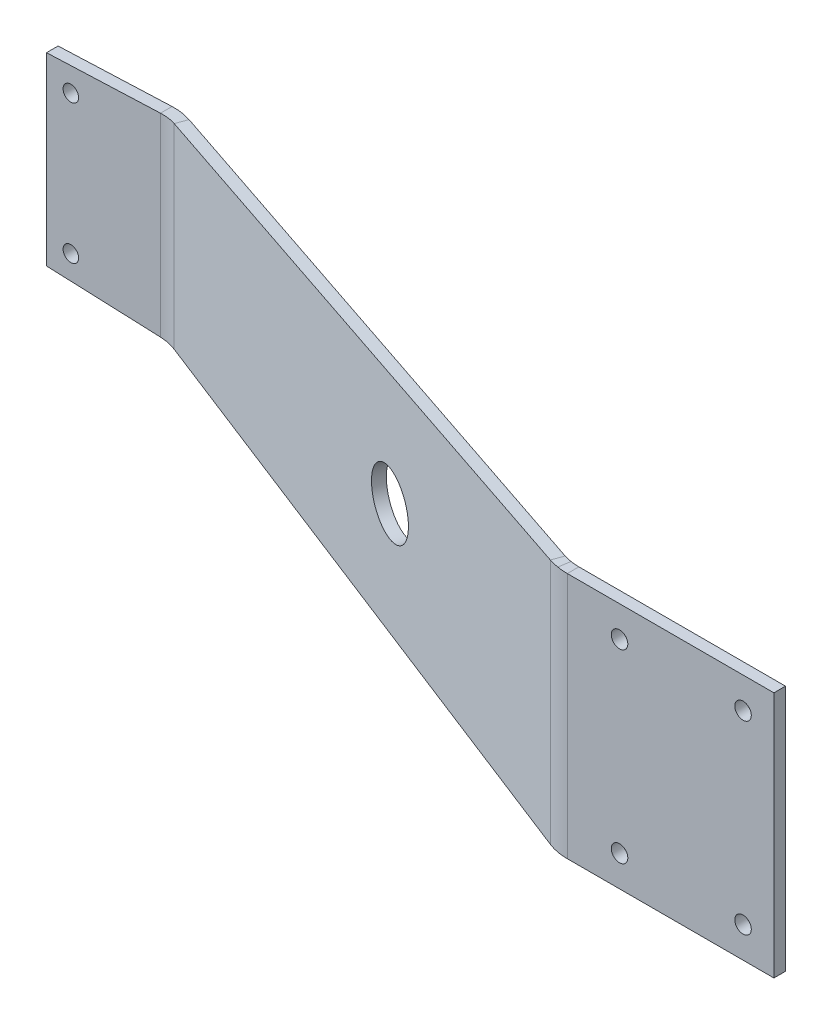
ISO-10303-21;
HEADER;
FILE_DESCRIPTION(('STEP AP214'),'2;1');
FILE_NAME('part.step','',(''),(''),'','','');
FILE_SCHEMA(('AUTOMOTIVE_DESIGN { 1 0 10303 214 1 1 1 1 }'));
ENDSEC;
DATA;
#1=APPLICATION_CONTEXT('core data for automotive mechanical design processes');
#2=APPLICATION_PROTOCOL_DEFINITION('international standard','automotive_design',2000,#1);
#3=PRODUCT_CONTEXT('',#1,'mechanical');
#4=PRODUCT('Part','Part','',(#3));
#5=PRODUCT_RELATED_PRODUCT_CATEGORY('part','',(#4));
#6=PRODUCT_DEFINITION_FORMATION('','',#4);
#7=PRODUCT_DEFINITION_CONTEXT('part definition',#1,'design');
#8=PRODUCT_DEFINITION('design','',#6,#7);
#9=PRODUCT_DEFINITION_SHAPE('','',#8);
#10=(LENGTH_UNIT() NAMED_UNIT(*) SI_UNIT(.MILLI.,.METRE.));
#11=(NAMED_UNIT(*) PLANE_ANGLE_UNIT() SI_UNIT($,.RADIAN.));
#12=(NAMED_UNIT(*) SI_UNIT($,.STERADIAN.) SOLID_ANGLE_UNIT());
#13=UNCERTAINTY_MEASURE_WITH_UNIT(LENGTH_MEASURE(1.E-05),#10,'distance_accuracy_value','');
#14=(GEOMETRIC_REPRESENTATION_CONTEXT(3) GLOBAL_UNCERTAINTY_ASSIGNED_CONTEXT((#13)) GLOBAL_UNIT_ASSIGNED_CONTEXT((#10,
#11,#12)) REPRESENTATION_CONTEXT('',''));
#15=CARTESIAN_POINT('',(0.,0.,0.));
#16=DIRECTION('',(0.,0.,1.));
#17=DIRECTION('',(1.,0.,0.));
#18=AXIS2_PLACEMENT_3D('',#15,#16,#17);
#19=CARTESIAN_POINT('',(1.16353213647621,76.15,-6.37099851140792));
#20=DIRECTION('',(-0.0378529223974013,0.999188341230153,-0.0137773370326425));
#21=DIRECTION('',(0.938929911029287,0.04028223863857,0.341742539676875));
#22=AXIS2_PLACEMENT_3D('',#19,#20,#21);
#23=PLANE('',#22);
#24=DIRECTION('',(0.938929911029287,0.04028223863857,0.341742539676875));
#25=VECTOR('',#24,1.);
#26=CARTESIAN_POINT('',(1.16353213647621,76.15,-6.37099851140792));
#27=LINE('',#26,#25);
#28=CARTESIAN_POINT('',(26.8670689171968,77.25274046049,2.98432379214092));
#29=VERTEX_POINT('',#28);
#30=CARTESIAN_POINT('',(148.504391473481,82.4712595395101,47.2566885784653));
#31=VERTEX_POINT('',#30);
#32=EDGE_CURVE('E616',#29,#31,#27,.T.);
#33=ORIENTED_EDGE('',*,*,#32,.T.);
#34=CARTESIAN_POINT('',(149.318826939775,82.4712595395101,45.0190455252188));
#35=CARTESIAN_POINT('',(148.504391473481,82.4712595395101,47.2566885784653));
#36=B_SPLINE_CURVE_WITH_KNOTS('',1,(#34,#35),.UNSPECIFIED.,.F.,.F.,(2,2),(0.,1.),.UNSPECIFIED.);
#37=CARTESIAN_POINT('',(149.318826939775,82.4712595395101,45.0190455252188));
#38=VERTEX_POINT('',#37);
#39=EDGE_CURVE('E12',#31,#38,#36,.F.);
#40=ORIENTED_EDGE('',*,*,#39,.T.);
#41=DIRECTION('',(0.938929911029287,0.04028223863857,0.341742539676875));
#42=VECTOR('',#41,1.);
#43=CARTESIAN_POINT('',(1.97796760277046,76.15,-8.60864156465436));
#44=LINE('',#43,#42);
#45=CARTESIAN_POINT('',(27.681504383491,77.25274046049,0.746680738894476));
#46=VERTEX_POINT('',#45);
#47=EDGE_CURVE('E549',#46,#38,#44,.T.);
#48=ORIENTED_EDGE('',*,*,#47,.F.);
#49=CARTESIAN_POINT('',(26.8670689171968,77.25274046049,2.98432379214092));
#50=CARTESIAN_POINT('',(27.681504383491,77.25274046049,0.746680738894478));
#51=B_SPLINE_CURVE_WITH_KNOTS('',1,(#49,#50),.UNSPECIFIED.,.F.,.F.,(2,2),(0.,1.),.UNSPECIFIED.);
#52=EDGE_CURVE('E449',#29,#46,#51,.T.);
#53=ORIENTED_EDGE('',*,*,#52,.F.);
#54=EDGE_LOOP('',(#33,#40,#48,#53));
#55=FACE_BOUND('',#54,.T.);
#56=ADVANCED_FACE('F71',(#55),#23,.T.);
#57=CARTESIAN_POINT('',(1.16353213647621,38.15,-6.37099851140792));
#58=DIRECTION('',(-0.037852922397401,-0.999188341230153,-0.0137773370326425));
#59=DIRECTION('',(-0.938929911029287,0.0402822386385698,-0.341742539676875));
#60=AXIS2_PLACEMENT_3D('',#57,#58,#59);
#61=PLANE('',#60);
#62=DIRECTION('',(-0.938929911029287,0.0402822386385698,-0.341742539676875));
#63=VECTOR('',#62,1.);
#64=CARTESIAN_POINT('',(1.97796760277046,38.15,-8.60864156465437));
#65=LINE('',#64,#63);
#66=CARTESIAN_POINT('',(149.318826939775,31.82874046049,45.0190455252188));
#67=VERTEX_POINT('',#66);
#68=CARTESIAN_POINT('',(27.681504383491,37.04725953951,0.746680738894476));
#69=VERTEX_POINT('',#68);
#70=EDGE_CURVE('E98',#67,#69,#65,.T.);
#71=ORIENTED_EDGE('',*,*,#70,.F.);
#72=CARTESIAN_POINT('',(148.504391473481,31.82874046049,47.2566885784653));
#73=CARTESIAN_POINT('',(149.318826939775,31.82874046049,45.0190455252188));
#74=B_SPLINE_CURVE_WITH_KNOTS('',1,(#72,#73),.UNSPECIFIED.,.F.,.F.,(2,2),(0.,1.),.UNSPECIFIED.);
#75=CARTESIAN_POINT('',(148.504391473481,31.82874046049,47.2566885784653));
#76=VERTEX_POINT('',#75);
#77=EDGE_CURVE('E596',#67,#76,#74,.F.);
#78=ORIENTED_EDGE('',*,*,#77,.T.);
#79=DIRECTION('',(-0.938929911029287,0.0402822386385698,-0.341742539676875));
#80=VECTOR('',#79,1.);
#81=CARTESIAN_POINT('',(1.16353213647621,38.15,-6.37099851140792));
#82=LINE('',#81,#80);
#83=CARTESIAN_POINT('',(26.8670689171968,37.04725953951,2.98432379214092));
#84=VERTEX_POINT('',#83);
#85=EDGE_CURVE('E553',#76,#84,#82,.T.);
#86=ORIENTED_EDGE('',*,*,#85,.T.);
#87=CARTESIAN_POINT('',(27.6815043834911,37.04725953951,0.746680738894478));
#88=CARTESIAN_POINT('',(26.8670689171968,37.04725953951,2.98432379214092));
#89=B_SPLINE_CURVE_WITH_KNOTS('',1,(#87,#88),.UNSPECIFIED.,.F.,.F.,(2,2),(0.,1.),.UNSPECIFIED.);
#90=EDGE_CURVE('E463',#69,#84,#89,.T.);
#91=ORIENTED_EDGE('',*,*,#90,.F.);
#92=EDGE_LOOP('',(#71,#78,#86,#91));
#93=FACE_BOUND('',#92,.T.);
#94=ADVANCED_FACE('F563',(#93),#61,.T.);
#95=CARTESIAN_POINT('',(1.97796760277046,0.,-8.60864156465437));
#96=DIRECTION('',(0.342020143325669,0.,-0.939692620785908));
#97=DIRECTION('',(-0.939692620785908,0.,-0.342020143325669));
#98=AXIS2_PLACEMENT_3D('',#95,#96,#97);
#99=PLANE('',#98);
#100=CARTESIAN_POINT('',(97.4507378746187,57.15,26.1406049972336));
#101=DIRECTION('',(0.342020143325669,0.,-0.939692620785908));
#102=DIRECTION('',(-0.939692620785908,0.,-0.342020143325669));
#103=AXIS2_PLACEMENT_3D('',#100,#101,#102);
#104=CIRCLE('',#103,6.35);
#105=CARTESIAN_POINT('',(91.4836897326282,57.15,23.9687770871156));
#106=VERTEX_POINT('',#105);
#107=EDGE_CURVE('E545',#106,#106,#104,.T.);
#108=ORIENTED_EDGE('',*,*,#107,.F.);
#109=EDGE_LOOP('',(#108));
#110=FACE_BOUND('',#109,.T.);
#111=ORIENTED_EDGE('',*,*,#47,.T.);
#112=DIRECTION('',(0.,-1.,0.));
#113=VECTOR('',#112,1.);
#114=CARTESIAN_POINT('',(149.318826939775,0.,45.0190455252188));
#115=LINE('',#114,#113);
#116=EDGE_CURVE('E82',#38,#67,#115,.T.);
#117=ORIENTED_EDGE('',*,*,#116,.T.);
#118=ORIENTED_EDGE('',*,*,#70,.T.);
#119=DIRECTION('',(0.,-1.,0.));
#120=VECTOR('',#119,1.);
#121=CARTESIAN_POINT('',(27.681504383491,0.,0.746680738894476));
#122=LINE('',#121,#120);
#123=EDGE_CURVE('E561',#46,#69,#122,.T.);
#124=ORIENTED_EDGE('',*,*,#123,.F.);
#125=EDGE_LOOP('',(#111,#117,#118,#124));
#126=FACE_BOUND('',#125,.T.);
#127=ADVANCED_FACE('F73',(#110,#126),#99,.T.);
#128=CARTESIAN_POINT('',(1.16353213647621,0.,-6.37099851140793));
#129=DIRECTION('',(0.342020143325669,0.,-0.939692620785908));
#130=DIRECTION('',(-0.939692620785908,0.,-0.342020143325669));
#131=AXIS2_PLACEMENT_3D('',#128,#129,#130);
#132=PLANE('',#131);
#133=DIRECTION('',(0.,-1.,0.));
#134=VECTOR('',#133,1.);
#135=CARTESIAN_POINT('',(148.504391473481,0.,47.2566885784653));
#136=LINE('',#135,#134);
#137=EDGE_CURVE('E589',#31,#76,#136,.T.);
#138=ORIENTED_EDGE('',*,*,#137,.F.);
#139=ORIENTED_EDGE('',*,*,#32,.F.);
#140=DIRECTION('',(0.,-1.,0.));
#141=VECTOR('',#140,1.);
#142=CARTESIAN_POINT('',(26.8670689171968,0.,2.98432379214092));
#143=LINE('',#142,#141);
#144=EDGE_CURVE('E550',#29,#84,#143,.T.);
#145=ORIENTED_EDGE('',*,*,#144,.T.);
#146=ORIENTED_EDGE('',*,*,#85,.F.);
#147=EDGE_LOOP('',(#138,#139,#145,#146));
#148=FACE_BOUND('',#147,.T.);
#149=CARTESIAN_POINT('',(96.6363024083245,57.15,28.3782480504801));
#150=DIRECTION('',(-0.342020143325669,0.,0.939692620785908));
#151=DIRECTION('',(0.939692620785908,0.,0.342020143325669));
#152=AXIS2_PLACEMENT_3D('',#149,#150,#151);
#153=CIRCLE('',#152,6.35);
#154=CARTESIAN_POINT('',(102.603350550315,57.15,30.5500759605981));
#155=VERTEX_POINT('',#154);
#156=EDGE_CURVE('E542',#155,#155,#153,.T.);
#157=ORIENTED_EDGE('',*,*,#156,.F.);
#158=EDGE_LOOP('',(#157));
#159=FACE_BOUND('',#158,.T.);
#160=ADVANCED_FACE('F576',(#148,#159),#132,.F.);
#161=CARTESIAN_POINT('',(97.5050335723717,57.15,25.9914287936839));
#162=DIRECTION('',(-0.342020143325669,0.,0.939692620785908));
#163=DIRECTION('',(0.939692620785908,0.,0.342020143325669));
#164=AXIS2_PLACEMENT_3D('',#161,#162,#163);
#165=CYLINDRICAL_SURFACE('',#164,6.35);
#166=ORIENTED_EDGE('',*,*,#107,.T.);
#167=EDGE_LOOP('',(#166));
#168=FACE_BOUND('',#167,.T.);
#169=ORIENTED_EDGE('',*,*,#156,.T.);
#170=EDGE_LOOP('',(#169));
#171=FACE_BOUND('',#170,.T.);
#172=ADVANCED_FACE('F525',(#168,#171),#165,.F.);
#173=CARTESIAN_POINT('',(0.,82.55,2.38125));
#174=DIRECTION('',(1.,0.,0.));
#175=DIRECTION('',(0.,-1.,0.));
#176=AXIS2_PLACEMENT_3D('',#173,#174,#175);
#177=PLANE('',#176);
#178=DIRECTION('',(0.,0.,1.));
#179=VECTOR('',#178,1.);
#180=CARTESIAN_POINT('',(0.,76.15,2.38125));
#181=LINE('',#180,#179);
#182=CARTESIAN_POINT('',(0.,76.15,0.));
#183=VERTEX_POINT('',#182);
#184=CARTESIAN_POINT('',(0.,76.15,2.38125));
#185=VERTEX_POINT('',#184);
#186=EDGE_CURVE('E467',#183,#185,#181,.T.);
#187=ORIENTED_EDGE('',*,*,#186,.F.);
#188=DIRECTION('',(0.,1.,0.));
#189=VECTOR('',#188,1.);
#190=CARTESIAN_POINT('',(0.,0.,0.));
#191=LINE('',#190,#189);
#192=CARTESIAN_POINT('',(0.,38.15,0.));
#193=VERTEX_POINT('',#192);
#194=EDGE_CURVE('E483',#183,#193,#191,.F.);
#195=ORIENTED_EDGE('',*,*,#194,.T.);
#196=DIRECTION('',(0.,0.,1.));
#197=VECTOR('',#196,1.);
#198=CARTESIAN_POINT('',(0.,38.15,2.38125));
#199=LINE('',#198,#197);
#200=CARTESIAN_POINT('',(0.,38.15,2.38125));
#201=VERTEX_POINT('',#200);
#202=EDGE_CURVE('E480',#193,#201,#199,.T.);
#203=ORIENTED_EDGE('',*,*,#202,.T.);
#204=DIRECTION('',(0.,-1.,0.));
#205=VECTOR('',#204,1.);
#206=CARTESIAN_POINT('',(0.,82.55,2.38125));
#207=LINE('',#206,#205);
#208=EDGE_CURVE('E476',#185,#201,#207,.T.);
#209=ORIENTED_EDGE('',*,*,#208,.F.);
#210=EDGE_LOOP('',(#187,#195,#203,#209));
#211=FACE_BOUND('',#210,.T.);
#212=ADVANCED_FACE('F423',(#211),#177,.F.);
#213=CARTESIAN_POINT('',(0.,0.,2.38125));
#214=DIRECTION('',(0.,0.,-1.));
#215=DIRECTION('',(-1.,0.,0.));
#216=AXIS2_PLACEMENT_3D('',#213,#214,#215);
#217=PLANE('',#216);
#218=CARTESIAN_POINT('',(5.00000000000003,71.4375,2.38125));
#219=DIRECTION('',(0.,0.,1.));
#220=DIRECTION('',(1.,0.,0.));
#221=AXIS2_PLACEMENT_3D('',#218,#219,#220);
#222=CIRCLE('',#221,1.6);
#223=CARTESIAN_POINT('',(6.60000000000003,71.4375,2.38125));
#224=VERTEX_POINT('',#223);
#225=EDGE_CURVE('E720',#224,#224,#222,.T.);
#226=ORIENTED_EDGE('',*,*,#225,.F.);
#227=EDGE_LOOP('',(#226));
#228=FACE_BOUND('',#227,.T.);
#229=CARTESIAN_POINT('',(5.00000000000003,42.8625,2.38125));
#230=DIRECTION('',(0.,0.,1.));
#231=DIRECTION('',(1.,0.,0.));
#232=AXIS2_PLACEMENT_3D('',#229,#230,#231);
#233=CIRCLE('',#232,1.6);
#234=CARTESIAN_POINT('',(6.60000000000003,42.8625,2.38125));
#235=VERTEX_POINT('',#234);
#236=EDGE_CURVE('E714',#235,#235,#233,.T.);
#237=ORIENTED_EDGE('',*,*,#236,.F.);
#238=EDGE_LOOP('',(#237));
#239=FACE_BOUND('',#238,.T.);
#240=DIRECTION('',(0.,-1.,0.));
#241=VECTOR('',#240,1.);
#242=CARTESIAN_POINT('',(23.4468674839401,0.,2.38125));
#243=LINE('',#242,#241);
#244=CARTESIAN_POINT('',(23.4468674839401,77.09525953951,2.38125));
#245=VERTEX_POINT('',#244);
#246=CARTESIAN_POINT('',(23.4468674839401,37.20474046049,2.38125));
#247=VERTEX_POINT('',#246);
#248=EDGE_CURVE('E486',#245,#247,#243,.T.);
#249=ORIENTED_EDGE('',*,*,#248,.F.);
#250=DIRECTION('',(0.999188341230153,0.0402822386385701,0.));
#251=VECTOR('',#250,1.);
#252=CARTESIAN_POINT('',(0.,76.15,2.38125));
#253=LINE('',#252,#251);
#254=EDGE_CURVE('E479',#185,#245,#253,.T.);
#255=ORIENTED_EDGE('',*,*,#254,.F.);
#256=ORIENTED_EDGE('',*,*,#208,.T.);
#257=DIRECTION('',(-0.999188341230153,0.0402822386385698,0.));
#258=VECTOR('',#257,1.);
#259=CARTESIAN_POINT('',(0.,38.15,2.38125));
#260=LINE('',#259,#258);
#261=EDGE_CURVE('E546',#247,#201,#260,.T.);
#262=ORIENTED_EDGE('',*,*,#261,.F.);
#263=EDGE_LOOP('',(#249,#255,#256,#262));
#264=FACE_BOUND('',#263,.T.);
#265=ADVANCED_FACE('F517',(#228,#239,#264),#217,.F.);
#266=CARTESIAN_POINT('',(0.,76.15,2.38125));
#267=DIRECTION('',(-0.0402822386385701,0.999188341230153,0.));
#268=DIRECTION('',(0.999188341230153,0.0402822386385701,0.));
#269=AXIS2_PLACEMENT_3D('',#266,#267,#268);
#270=PLANE('',#269);
#271=ORIENTED_EDGE('',*,*,#254,.T.);
#272=CARTESIAN_POINT('',(23.4468674839401,77.09525953951,0.));
#273=CARTESIAN_POINT('',(23.4468674839401,77.09525953951,2.38125));
#274=B_SPLINE_CURVE_WITH_KNOTS('',1,(#272,#273),.UNSPECIFIED.,.F.,.F.,(2,2),(0.,1.),.UNSPECIFIED.);
#275=CARTESIAN_POINT('',(23.4468674839401,77.09525953951,0.));
#276=VERTEX_POINT('',#275);
#277=EDGE_CURVE('E475',#245,#276,#274,.F.);
#278=ORIENTED_EDGE('',*,*,#277,.T.);
#279=DIRECTION('',(0.999188341230153,0.0402822386385701,0.));
#280=VECTOR('',#279,1.);
#281=CARTESIAN_POINT('',(0.,76.15,0.));
#282=LINE('',#281,#280);
#283=EDGE_CURVE('E474',#183,#276,#282,.T.);
#284=ORIENTED_EDGE('',*,*,#283,.F.);
#285=ORIENTED_EDGE('',*,*,#186,.T.);
#286=EDGE_LOOP('',(#271,#278,#284,#285));
#287=FACE_BOUND('',#286,.T.);
#288=ADVANCED_FACE('F507',(#287),#270,.T.);
#289=CARTESIAN_POINT('',(0.,0.,0.));
#290=DIRECTION('',(0.,0.,-1.));
#291=DIRECTION('',(-1.,0.,0.));
#292=AXIS2_PLACEMENT_3D('',#289,#290,#291);
#293=PLANE('',#292);
#294=CARTESIAN_POINT('',(5.00000000000003,71.4375,0.));
#295=DIRECTION('',(0.,0.,-1.));
#296=DIRECTION('',(-1.,0.,0.));
#297=AXIS2_PLACEMENT_3D('',#294,#295,#296);
#298=CIRCLE('',#297,1.6);
#299=CARTESIAN_POINT('',(3.40000000000003,71.4375,0.));
#300=VERTEX_POINT('',#299);
#301=EDGE_CURVE('E717',#300,#300,#298,.T.);
#302=ORIENTED_EDGE('',*,*,#301,.F.);
#303=EDGE_LOOP('',(#302));
#304=FACE_BOUND('',#303,.T.);
#305=CARTESIAN_POINT('',(5.00000000000003,42.8625,0.));
#306=DIRECTION('',(0.,0.,-1.));
#307=DIRECTION('',(-1.,0.,0.));
#308=AXIS2_PLACEMENT_3D('',#305,#306,#307);
#309=CIRCLE('',#308,1.6);
#310=CARTESIAN_POINT('',(3.40000000000003,42.8625,0.));
#311=VERTEX_POINT('',#310);
#312=EDGE_CURVE('E210',#311,#311,#309,.T.);
#313=ORIENTED_EDGE('',*,*,#312,.F.);
#314=EDGE_LOOP('',(#313));
#315=FACE_BOUND('',#314,.T.);
#316=ORIENTED_EDGE('',*,*,#283,.T.);
#317=DIRECTION('',(0.,-1.,0.));
#318=VECTOR('',#317,1.);
#319=CARTESIAN_POINT('',(23.4468674839401,0.,0.));
#320=LINE('',#319,#318);
#321=CARTESIAN_POINT('',(23.4468674839401,37.20474046049,0.));
#322=VERTEX_POINT('',#321);
#323=EDGE_CURVE('E487',#276,#322,#320,.T.);
#324=ORIENTED_EDGE('',*,*,#323,.T.);
#325=DIRECTION('',(-0.999188341230153,0.0402822386385698,0.));
#326=VECTOR('',#325,1.);
#327=CARTESIAN_POINT('',(0.,38.15,0.));
#328=LINE('',#327,#326);
#329=EDGE_CURVE('E490',#322,#193,#328,.T.);
#330=ORIENTED_EDGE('',*,*,#329,.T.);
#331=ORIENTED_EDGE('',*,*,#194,.F.);
#332=EDGE_LOOP('',(#316,#324,#330,#331));
#333=FACE_BOUND('',#332,.T.);
#334=ADVANCED_FACE('F516',(#304,#315,#333),#293,.T.);
#335=CARTESIAN_POINT('',(0.,38.15,2.38125));
#336=DIRECTION('',(-0.0402822386385698,-0.999188341230153,0.));
#337=DIRECTION('',(-0.999188341230153,0.0402822386385698,0.));
#338=AXIS2_PLACEMENT_3D('',#335,#336,#337);
#339=PLANE('',#338);
#340=ORIENTED_EDGE('',*,*,#329,.F.);
#341=CARTESIAN_POINT('',(23.4468674839401,37.20474046049,2.38125));
#342=CARTESIAN_POINT('',(23.4468674839401,37.20474046049,0.));
#343=B_SPLINE_CURVE_WITH_KNOTS('',1,(#341,#342),.UNSPECIFIED.,.F.,.F.,(2,2),(0.,1.),.UNSPECIFIED.);
#344=EDGE_CURVE('E539',#322,#247,#343,.F.);
#345=ORIENTED_EDGE('',*,*,#344,.T.);
#346=ORIENTED_EDGE('',*,*,#261,.T.);
#347=ORIENTED_EDGE('',*,*,#202,.F.);
#348=EDGE_LOOP('',(#340,#345,#346,#347));
#349=FACE_BOUND('',#348,.T.);
#350=ADVANCED_FACE('F419',(#349),#339,.T.);
#351=CARTESIAN_POINT('',(27.681504383491,77.25274046049,0.746680738894478));
#352=CARTESIAN_POINT('',(26.3272425370765,77.2002267244741,0.253769737397179));
#353=CARTESIAN_POINT('',(24.8880428390067,77.1477732755259,0.));
#354=CARTESIAN_POINT('',(23.4468674839401,77.09525953951,0.));
#355=CARTESIAN_POINT('',(26.8670689171968,77.25274046049,2.98432379214092));
#356=CARTESIAN_POINT('',(25.7732685846946,77.2002267364846,2.58621302887965));
#357=CARTESIAN_POINT('',(24.6108654853157,77.1477732635154,2.38125));
#358=CARTESIAN_POINT('',(23.4468674839401,77.09525953951,2.38125));
#359=B_SPLINE_SURFACE_WITH_KNOTS('',1,3,((#351,#352,#353,#354),(#355,#356,#357,#358)),
.UNSPECIFIED.,.F.,.F.,.F.,(2,2),(4,4),(0.,1.),(0.,1.),.UNSPECIFIED.);
#360=CARTESIAN_POINT('',(27.681504383491,77.25274046049,0.746680738894478));
#361=CARTESIAN_POINT('',(26.3272425370765,77.2002267244741,0.253769737397179));
#362=CARTESIAN_POINT('',(24.8880428390067,77.1477732755259,0.));
#363=CARTESIAN_POINT('',(23.4468674839401,77.09525953951,0.));
#364=B_SPLINE_CURVE_WITH_KNOTS('',3,(#360,#361,#362,#363),.UNSPECIFIED.,.F.,.F.,(4,4),(0.,1.),.UNSPECIFIED.);
#365=EDGE_CURVE('E391',#46,#276,#364,.T.);
#366=CARTESIAN_POINT('',(23.4468674839401,77.09525953951,2.38125));
#367=CARTESIAN_POINT('',(24.6108654853157,77.1477732635154,2.38125));
#368=CARTESIAN_POINT('',(25.7732685846946,77.2002267364846,2.58621302887965));
#369=CARTESIAN_POINT('',(26.8670689171968,77.25274046049,2.98432379214092));
#370=B_SPLINE_CURVE_WITH_KNOTS('',3,(#366,#367,#368,#369),.UNSPECIFIED.,.F.,.F.,(4,4),(0.,1.),.UNSPECIFIED.);
#371=EDGE_CURVE('E384',#29,#245,#370,.F.);
#372=ORIENTED_EDGE('',*,*,#52,.T.);
#373=ORIENTED_EDGE('',*,*,#365,.T.);
#374=ORIENTED_EDGE('',*,*,#277,.F.);
#375=ORIENTED_EDGE('',*,*,#371,.F.);
#376=EDGE_LOOP('',(#372,#373,#374,#375));
#377=FACE_BOUND('',#376,.T.);
#378=ADVANCED_FACE('F408',(#377),#359,.F.);
#379=CARTESIAN_POINT('',(23.4468674839401,37.20474046049,0.));
#380=CARTESIAN_POINT('',(24.8880428390067,37.1522267244741,0.));
#381=CARTESIAN_POINT('',(26.3272425370764,37.0997732755259,0.253769737397168));
#382=CARTESIAN_POINT('',(27.6815043834911,37.04725953951,0.746680738894478));
#383=CARTESIAN_POINT('',(23.4468674839401,37.20474046049,2.38125));
#384=CARTESIAN_POINT('',(24.6108654853157,37.1522267364846,2.38125));
#385=CARTESIAN_POINT('',(25.7732685846946,37.0997732635154,2.58621302887965));
#386=CARTESIAN_POINT('',(26.8670689171968,37.04725953951,2.98432379214092));
#387=B_SPLINE_SURFACE_WITH_KNOTS('',1,3,((#379,#380,#381,#382),(#383,#384,#385,#386)),
.UNSPECIFIED.,.F.,.F.,.F.,(2,2),(4,4),(0.,1.),(0.,1.),.UNSPECIFIED.);
#388=CARTESIAN_POINT('',(23.4468674839401,37.20474046049,0.));
#389=CARTESIAN_POINT('',(24.8880428390067,37.1522267244741,0.));
#390=CARTESIAN_POINT('',(26.3272425370764,37.0997732755259,0.253769737397168));
#391=CARTESIAN_POINT('',(27.6815043834911,37.04725953951,0.746680738894478));
#392=B_SPLINE_CURVE_WITH_KNOTS('',3,(#388,#389,#390,#391),.UNSPECIFIED.,.F.,.F.,(4,4),(0.,1.),.UNSPECIFIED.);
#393=EDGE_CURVE('E618',#322,#69,#392,.T.);
#394=CARTESIAN_POINT('',(26.8670689171968,37.04725953951,2.98432379214092));
#395=CARTESIAN_POINT('',(25.7732685846946,37.0997732635154,2.58621302887965));
#396=CARTESIAN_POINT('',(24.6108654853157,37.1522267364846,2.38125));
#397=CARTESIAN_POINT('',(23.4468674839401,37.20474046049,2.38125));
#398=B_SPLINE_CURVE_WITH_KNOTS('',3,(#394,#395,#396,#397),.UNSPECIFIED.,.F.,.F.,(4,4),(0.,1.),.UNSPECIFIED.);
#399=EDGE_CURVE('E653',#247,#84,#398,.F.);
#400=ORIENTED_EDGE('',*,*,#344,.F.);
#401=ORIENTED_EDGE('',*,*,#393,.T.);
#402=ORIENTED_EDGE('',*,*,#90,.T.);
#403=ORIENTED_EDGE('',*,*,#399,.F.);
#404=EDGE_LOOP('',(#400,#401,#402,#403));
#405=FACE_BOUND('',#404,.T.);
#406=ADVANCED_FACE('F362',(#405),#387,.F.);
#407=CARTESIAN_POINT('',(23.4468674839401,16.685077484926,12.38125));
#408=DIRECTION('',(0.,1.,0.));
#409=DIRECTION('',(-1.,0.,0.));
#410=AXIS2_PLACEMENT_3D('',#407,#408,#409);
#411=CYLINDRICAL_SURFACE('',#410,10.);
#412=ORIENTED_EDGE('',*,*,#399,.T.);
#413=ORIENTED_EDGE('',*,*,#144,.F.);
#414=ORIENTED_EDGE('',*,*,#371,.T.);
#415=ORIENTED_EDGE('',*,*,#248,.T.);
#416=EDGE_LOOP('',(#412,#413,#414,#415));
#417=FACE_BOUND('',#416,.T.);
#418=ADVANCED_FACE('F353',(#417),#411,.F.);
#419=CARTESIAN_POINT('',(23.4468674839401,16.685077484926,12.38125));
#420=DIRECTION('',(0.,1.,0.));
#421=DIRECTION('',(-1.,0.,0.));
#422=AXIS2_PLACEMENT_3D('',#419,#420,#421);
#423=CYLINDRICAL_SURFACE('',#422,12.38125);
#424=ORIENTED_EDGE('',*,*,#393,.F.);
#425=ORIENTED_EDGE('',*,*,#323,.F.);
#426=ORIENTED_EDGE('',*,*,#365,.F.);
#427=ORIENTED_EDGE('',*,*,#123,.T.);
#428=EDGE_LOOP('',(#424,#425,#426,#427));
#429=FACE_BOUND('',#428,.T.);
#430=ADVANCED_FACE('F299',(#429),#423,.T.);
#431=CARTESIAN_POINT('',(150.589046873293,82.55,47.8152703093421));
#432=CARTESIAN_POINT('',(149.879658823564,82.5237524664823,47.6901860563828));
#433=CARTESIAN_POINT('',(149.181281672167,82.4975070730278,47.5030564626535));
#434=CARTESIAN_POINT('',(148.504391473481,82.4712595395101,47.2566885784653));
#435=CARTESIAN_POINT('',(151.002546596362,82.55,45.4701968474818));
#436=CARTESIAN_POINT('',(150.429593108864,82.523752466964,45.3691696889448));
#437=CARTESIAN_POINT('',(149.865532794404,82.497507072546,45.218030183203));
#438=CARTESIAN_POINT('',(149.318826939775,82.4712595395101,45.0190455252188));
#439=B_SPLINE_SURFACE_WITH_KNOTS('',1,3,((#431,#432,#433,#434),(#435,#436,#437,#438)),
.UNSPECIFIED.,.F.,.F.,.F.,(2,2),(4,4),(0.,1.),(0.,1.),.UNSPECIFIED.);
#440=CARTESIAN_POINT('',(150.589046873293,82.55,47.8152703093421));
#441=CARTESIAN_POINT('',(151.002546596362,82.55,45.4701968474818));
#442=B_SPLINE_CURVE_WITH_KNOTS('',1,(#440,#441),.UNSPECIFIED.,.F.,.F.,(2,2),(0.,1.),.UNSPECIFIED.);
#443=CARTESIAN_POINT('',(151.002546596362,82.55,45.4701968474818));
#444=VERTEX_POINT('',#443);
#445=CARTESIAN_POINT('',(150.589046873293,82.55,47.8152703093421));
#446=VERTEX_POINT('',#445);
#447=EDGE_CURVE('E331',#444,#446,#442,.F.);
#448=CARTESIAN_POINT('',(151.002546596362,82.55,45.4701968474818));
#449=CARTESIAN_POINT('',(150.429593108864,82.523752466964,45.3691696889448));
#450=CARTESIAN_POINT('',(149.865532794404,82.497507072546,45.218030183203));
#451=CARTESIAN_POINT('',(149.318826939775,82.4712595395101,45.0190455252188));
#452=B_SPLINE_CURVE_WITH_KNOTS('',3,(#448,#449,#450,#451),.UNSPECIFIED.,.F.,.F.,(4,4),(0.,1.),.UNSPECIFIED.);
#453=EDGE_CURVE('E89',#444,#38,#452,.T.);
#454=CARTESIAN_POINT('',(148.504391473481,82.4712595395101,47.2566885784653));
#455=CARTESIAN_POINT('',(149.181281672167,82.4975070730278,47.5030564626535));
#456=CARTESIAN_POINT('',(149.879658823564,82.5237524664823,47.6901860563828));
#457=CARTESIAN_POINT('',(150.589046873293,82.55,47.8152703093421));
#458=B_SPLINE_CURVE_WITH_KNOTS('',3,(#454,#455,#456,#457),.UNSPECIFIED.,.F.,.F.,(4,4),(0.,1.),.UNSPECIFIED.);
#459=EDGE_CURVE('E260',#446,#31,#458,.F.);
#460=ORIENTED_EDGE('',*,*,#447,.F.);
#461=ORIENTED_EDGE('',*,*,#453,.T.);
#462=ORIENTED_EDGE('',*,*,#39,.F.);
#463=ORIENTED_EDGE('',*,*,#459,.F.);
#464=EDGE_LOOP('',(#460,#461,#462,#463));
#465=FACE_BOUND('',#464,.T.);
#466=ADVANCED_FACE('F287',(#465),#439,.T.);
#467=CARTESIAN_POINT('',(148.504391473481,31.82874046049,47.2566885784653));
#468=CARTESIAN_POINT('',(149.181281672167,31.8024929269723,47.5030564626535));
#469=CARTESIAN_POINT('',(149.879658823564,31.7762475335177,47.6901860563828));
#470=CARTESIAN_POINT('',(150.589046873293,31.75,47.8152703093421));
#471=CARTESIAN_POINT('',(149.318826939775,31.82874046049,45.0190455252188));
#472=CARTESIAN_POINT('',(149.865532794404,31.802492927454,45.218030183203));
#473=CARTESIAN_POINT('',(150.429593108863,31.776247533036,45.3691696889448));
#474=CARTESIAN_POINT('',(151.002546596362,31.75,45.4701968474818));
#475=B_SPLINE_SURFACE_WITH_KNOTS('',1,3,((#467,#468,#469,#470),(#471,#472,#473,#474)),
.UNSPECIFIED.,.F.,.F.,.F.,(2,2),(4,4),(0.,1.),(0.,1.),.UNSPECIFIED.);
#476=CARTESIAN_POINT('',(149.318826939775,31.82874046049,45.0190455252188));
#477=CARTESIAN_POINT('',(149.865532794404,31.802492927454,45.218030183203));
#478=CARTESIAN_POINT('',(150.429593108863,31.776247533036,45.3691696889448));
#479=CARTESIAN_POINT('',(151.002546596362,31.75,45.4701968474818));
#480=B_SPLINE_CURVE_WITH_KNOTS('',3,(#476,#477,#478,#479),.UNSPECIFIED.,.F.,.F.,(4,4),(0.,1.),.UNSPECIFIED.);
#481=CARTESIAN_POINT('',(151.002546596362,31.75,45.4701968474818));
#482=VERTEX_POINT('',#481);
#483=EDGE_CURVE('E215',#67,#482,#480,.T.);
#484=CARTESIAN_POINT('',(151.002546596362,31.75,45.4701968474818));
#485=CARTESIAN_POINT('',(150.589046873293,31.75,47.8152703093421));
#486=B_SPLINE_CURVE_WITH_KNOTS('',1,(#484,#485),.UNSPECIFIED.,.F.,.F.,(2,2),(0.,1.),.UNSPECIFIED.);
#487=CARTESIAN_POINT('',(150.589046873293,31.75,47.8152703093421));
#488=VERTEX_POINT('',#487);
#489=EDGE_CURVE('E264',#482,#488,#486,.T.);
#490=CARTESIAN_POINT('',(150.589046873293,31.75,47.8152703093421));
#491=CARTESIAN_POINT('',(149.879658823564,31.7762475335177,47.6901860563828));
#492=CARTESIAN_POINT('',(149.181281672167,31.8024929269723,47.5030564626535));
#493=CARTESIAN_POINT('',(148.504391473481,31.82874046049,47.2566885784653));
#494=B_SPLINE_CURVE_WITH_KNOTS('',3,(#490,#491,#492,#493),.UNSPECIFIED.,.F.,.F.,(4,4),(0.,1.),.UNSPECIFIED.);
#495=EDGE_CURVE('E684',#76,#488,#494,.F.);
#496=ORIENTED_EDGE('',*,*,#77,.F.);
#497=ORIENTED_EDGE('',*,*,#483,.T.);
#498=ORIENTED_EDGE('',*,*,#489,.T.);
#499=ORIENTED_EDGE('',*,*,#495,.F.);
#500=EDGE_LOOP('',(#496,#497,#498,#499));
#501=FACE_BOUND('',#500,.T.);
#502=ADVANCED_FACE('F298',(#501),#475,.T.);
#503=CARTESIAN_POINT('',(152.739028373032,31.75,35.6221193173597));
#504=DIRECTION('',(0.,-1.,0.));
#505=DIRECTION('',(0.,0.,-1.));
#506=AXIS2_PLACEMENT_3D('',#503,#504,#505);
#507=PLANE('',#506);
#508=ORIENTED_EDGE('',*,*,#489,.F.);
#509=CARTESIAN_POINT('',(152.739028373032,31.75,35.6221193173597));
#510=DIRECTION('',(0.,1.,0.));
#511=DIRECTION('',(0.,0.,1.));
#512=AXIS2_PLACEMENT_3D('',#509,#510,#511);
#513=CIRCLE('',#512,10.);
#514=CARTESIAN_POINT('',(152.739028373032,31.75,45.6221193173597));
#515=VERTEX_POINT('',#514);
#516=EDGE_CURVE('E211',#482,#515,#513,.T.);
#517=ORIENTED_EDGE('',*,*,#516,.T.);
#518=DIRECTION('',(0.,0.,1.));
#519=VECTOR('',#518,1.);
#520=CARTESIAN_POINT('',(152.739028373032,31.75,48.0033693173597));
#521=LINE('',#520,#519);
#522=CARTESIAN_POINT('',(152.739028373032,31.75,48.0033693173597));
#523=VERTEX_POINT('',#522);
#524=EDGE_CURVE('E201',#515,#523,#521,.T.);
#525=ORIENTED_EDGE('',*,*,#524,.T.);
#526=CARTESIAN_POINT('',(152.739028373032,31.75,35.6221193173597));
#527=DIRECTION('',(0.,1.,0.));
#528=DIRECTION('',(0.,0.,1.));
#529=AXIS2_PLACEMENT_3D('',#526,#527,#528);
#530=CIRCLE('',#529,12.38125);
#531=EDGE_CURVE('E222',#488,#523,#530,.T.);
#532=ORIENTED_EDGE('',*,*,#531,.F.);
#533=EDGE_LOOP('',(#508,#517,#525,#532));
#534=FACE_BOUND('',#533,.T.);
#535=ADVANCED_FACE('F695',(#534),#507,.T.);
#536=CARTESIAN_POINT('',(152.739028373032,82.55,35.6221193173597));
#537=DIRECTION('',(0.,1.,0.));
#538=DIRECTION('',(0.,0.,1.));
#539=AXIS2_PLACEMENT_3D('',#536,#537,#538);
#540=PLANE('',#539);
#541=CARTESIAN_POINT('',(152.739028373032,82.55,35.6221193173597));
#542=DIRECTION('',(0.,1.,0.));
#543=DIRECTION('',(0.,0.,1.));
#544=AXIS2_PLACEMENT_3D('',#541,#542,#543);
#545=CIRCLE('',#544,10.);
#546=CARTESIAN_POINT('',(152.739028373032,82.55,45.6221193173597));
#547=VERTEX_POINT('',#546);
#548=EDGE_CURVE('E214',#547,#444,#545,.F.);
#549=ORIENTED_EDGE('',*,*,#548,.T.);
#550=ORIENTED_EDGE('',*,*,#447,.T.);
#551=CARTESIAN_POINT('',(152.739028373032,82.55,35.6221193173597));
#552=DIRECTION('',(0.,-1.,0.));
#553=DIRECTION('',(0.,0.,-1.));
#554=AXIS2_PLACEMENT_3D('',#551,#552,#553);
#555=CIRCLE('',#554,12.38125);
#556=CARTESIAN_POINT('',(152.739028373032,82.55,48.0033693173597));
#557=VERTEX_POINT('',#556);
#558=EDGE_CURVE('E262',#557,#446,#555,.T.);
#559=ORIENTED_EDGE('',*,*,#558,.F.);
#560=DIRECTION('',(0.,0.,-1.));
#561=VECTOR('',#560,1.);
#562=CARTESIAN_POINT('',(152.739028373032,82.55,48.0033693173597));
#563=LINE('',#562,#561);
#564=EDGE_CURVE('E208',#557,#547,#563,.T.);
#565=ORIENTED_EDGE('',*,*,#564,.T.);
#566=EDGE_LOOP('',(#549,#550,#559,#565));
#567=FACE_BOUND('',#566,.T.);
#568=ADVANCED_FACE('F236',(#567),#540,.T.);
#569=CARTESIAN_POINT('',(152.739028373032,6.02732975067237,35.6221193173597));
#570=DIRECTION('',(0.,1.,0.));
#571=DIRECTION('',(0.,0.,1.));
#572=AXIS2_PLACEMENT_3D('',#569,#570,#571);
#573=CYLINDRICAL_SURFACE('',#572,12.38125);
#574=DIRECTION('',(0.,-1.,0.));
#575=VECTOR('',#574,1.);
#576=CARTESIAN_POINT('',(152.739028373032,0.,48.0033693173597));
#577=LINE('',#576,#575);
#578=EDGE_CURVE('E704',#557,#523,#577,.T.);
#579=ORIENTED_EDGE('',*,*,#578,.F.);
#580=ORIENTED_EDGE('',*,*,#558,.T.);
#581=ORIENTED_EDGE('',*,*,#459,.T.);
#582=ORIENTED_EDGE('',*,*,#137,.T.);
#583=ORIENTED_EDGE('',*,*,#495,.T.);
#584=ORIENTED_EDGE('',*,*,#531,.T.);
#585=EDGE_LOOP('',(#579,#580,#581,#582,#583,#584));
#586=FACE_BOUND('',#585,.T.);
#587=ADVANCED_FACE('F225',(#586),#573,.T.);
#588=CARTESIAN_POINT('',(152.739028373032,6.02732975067237,35.6221193173597));
#589=DIRECTION('',(0.,1.,0.));
#590=DIRECTION('',(0.,0.,1.));
#591=AXIS2_PLACEMENT_3D('',#588,#589,#590);
#592=CYLINDRICAL_SURFACE('',#591,10.);
#593=DIRECTION('',(0.,-1.,0.));
#594=VECTOR('',#593,1.);
#595=CARTESIAN_POINT('',(152.739028373032,0.,45.6221193173597));
#596=LINE('',#595,#594);
#597=EDGE_CURVE('E194',#547,#515,#596,.T.);
#598=ORIENTED_EDGE('',*,*,#597,.T.);
#599=ORIENTED_EDGE('',*,*,#516,.F.);
#600=ORIENTED_EDGE('',*,*,#483,.F.);
#601=ORIENTED_EDGE('',*,*,#116,.F.);
#602=ORIENTED_EDGE('',*,*,#453,.F.);
#603=ORIENTED_EDGE('',*,*,#548,.F.);
#604=EDGE_LOOP('',(#598,#599,#600,#601,#602,#603));
#605=FACE_BOUND('',#604,.T.);
#606=ADVANCED_FACE('F235',(#605),#592,.F.);
#607=CARTESIAN_POINT('',(195.235895856972,82.55,48.0033693173597));
#608=DIRECTION('',(-1.,0.,0.));
#609=DIRECTION('',(0.,1.,0.));
#610=AXIS2_PLACEMENT_3D('',#607,#608,#609);
#611=PLANE('',#610);
#612=DIRECTION('',(0.,0.,1.));
#613=VECTOR('',#612,1.);
#614=CARTESIAN_POINT('',(195.235895856972,31.75,48.0033693173597));
#615=LINE('',#614,#613);
#616=CARTESIAN_POINT('',(195.235895856972,31.75,45.6221193173597));
#617=VERTEX_POINT('',#616);
#618=CARTESIAN_POINT('',(195.235895856972,31.75,48.0033693173597));
#619=VERTEX_POINT('',#618);
#620=EDGE_CURVE('E196',#617,#619,#615,.T.);
#621=ORIENTED_EDGE('',*,*,#620,.F.);
#622=DIRECTION('',(0.,1.,0.));
#623=VECTOR('',#622,1.);
#624=CARTESIAN_POINT('',(195.235895856972,0.,45.6221193173597));
#625=LINE('',#624,#623);
#626=CARTESIAN_POINT('',(195.235895856972,82.55,45.6221193173597));
#627=VERTEX_POINT('',#626);
#628=EDGE_CURVE('E188',#617,#627,#625,.T.);
#629=ORIENTED_EDGE('',*,*,#628,.T.);
#630=DIRECTION('',(0.,0.,1.));
#631=VECTOR('',#630,1.);
#632=CARTESIAN_POINT('',(195.235895856972,82.55,48.0033693173597));
#633=LINE('',#632,#631);
#634=CARTESIAN_POINT('',(195.235895856972,82.55,48.0033693173597));
#635=VERTEX_POINT('',#634);
#636=EDGE_CURVE('E177',#627,#635,#633,.T.);
#637=ORIENTED_EDGE('',*,*,#636,.T.);
#638=DIRECTION('',(0.,1.,0.));
#639=VECTOR('',#638,1.);
#640=CARTESIAN_POINT('',(195.235895856972,82.55,48.0033693173597));
#641=LINE('',#640,#639);
#642=EDGE_CURVE('E705',#619,#635,#641,.T.);
#643=ORIENTED_EDGE('',*,*,#642,.F.);
#644=EDGE_LOOP('',(#621,#629,#637,#643));
#645=FACE_BOUND('',#644,.T.);
#646=ADVANCED_FACE('F199',(#645),#611,.F.);
#647=CARTESIAN_POINT('',(-7.96410414302833,0.,48.0033693173598));
#648=DIRECTION('',(0.,0.,-1.));
#649=DIRECTION('',(-1.,0.,0.));
#650=AXIS2_PLACEMENT_3D('',#647,#648,#649);
#651=PLANE('',#650);
#652=CARTESIAN_POINT('',(188.885895856972,76.2,48.0033693173598));
#653=DIRECTION('',(0.,0.,1.));
#654=DIRECTION('',(1.,0.,0.));
#655=AXIS2_PLACEMENT_3D('',#652,#653,#654);
#656=CIRCLE('',#655,1.69999999999998);
#657=CARTESIAN_POINT('',(190.585895856972,76.2,48.0033693173598));
#658=VERTEX_POINT('',#657);
#659=EDGE_CURVE('E744',#658,#658,#656,.T.);
#660=ORIENTED_EDGE('',*,*,#659,.F.);
#661=EDGE_LOOP('',(#660));
#662=FACE_BOUND('',#661,.T.);
#663=CARTESIAN_POINT('',(188.885895856972,38.1,48.0033693173598));
#664=DIRECTION('',(0.,0.,1.));
#665=DIRECTION('',(1.,0.,0.));
#666=AXIS2_PLACEMENT_3D('',#663,#664,#665);
#667=CIRCLE('',#666,1.69999999999998);
#668=CARTESIAN_POINT('',(190.585895856972,38.1,48.0033693173598));
#669=VERTEX_POINT('',#668);
#670=EDGE_CURVE('E738',#669,#669,#667,.T.);
#671=ORIENTED_EDGE('',*,*,#670,.F.);
#672=EDGE_LOOP('',(#671));
#673=FACE_BOUND('',#672,.T.);
#674=CARTESIAN_POINT('',(163.485895856972,38.1,48.0033693173598));
#675=DIRECTION('',(0.,0.,1.));
#676=DIRECTION('',(1.,0.,0.));
#677=AXIS2_PLACEMENT_3D('',#674,#675,#676);
#678=CIRCLE('',#677,1.69999999999998);
#679=CARTESIAN_POINT('',(165.185895856972,38.1,48.0033693173598));
#680=VERTEX_POINT('',#679);
#681=EDGE_CURVE('E732',#680,#680,#678,.T.);
#682=ORIENTED_EDGE('',*,*,#681,.F.);
#683=EDGE_LOOP('',(#682));
#684=FACE_BOUND('',#683,.T.);
#685=CARTESIAN_POINT('',(163.485895856972,76.2,48.0033693173598));
#686=DIRECTION('',(0.,0.,1.));
#687=DIRECTION('',(1.,0.,0.));
#688=AXIS2_PLACEMENT_3D('',#685,#686,#687);
#689=CIRCLE('',#688,1.69999999999998);
#690=CARTESIAN_POINT('',(165.185895856972,76.2,48.0033693173598));
#691=VERTEX_POINT('',#690);
#692=EDGE_CURVE('E726',#691,#691,#689,.T.);
#693=ORIENTED_EDGE('',*,*,#692,.F.);
#694=EDGE_LOOP('',(#693));
#695=FACE_BOUND('',#694,.T.);
#696=DIRECTION('',(-1.,0.,0.));
#697=VECTOR('',#696,1.);
#698=CARTESIAN_POINT('',(195.235895856972,82.55,48.0033693173597));
#699=LINE('',#698,#697);
#700=EDGE_CURVE('E183',#635,#557,#699,.T.);
#701=ORIENTED_EDGE('',*,*,#700,.T.);
#702=ORIENTED_EDGE('',*,*,#578,.T.);
#703=DIRECTION('',(1.,0.,0.));
#704=VECTOR('',#703,1.);
#705=CARTESIAN_POINT('',(195.235895856972,31.75,48.0033693173597));
#706=LINE('',#705,#704);
#707=EDGE_CURVE('E701',#523,#619,#706,.T.);
#708=ORIENTED_EDGE('',*,*,#707,.T.);
#709=ORIENTED_EDGE('',*,*,#642,.T.);
#710=EDGE_LOOP('',(#701,#702,#708,#709));
#711=FACE_BOUND('',#710,.T.);
#712=ADVANCED_FACE('F703',(#662,#673,#684,#695,#711),#651,.F.);
#713=CARTESIAN_POINT('',(195.235895856972,31.75,48.0033693173597));
#714=DIRECTION('',(0.,1.,0.));
#715=DIRECTION('',(1.,0.,0.));
#716=AXIS2_PLACEMENT_3D('',#713,#714,#715);
#717=PLANE('',#716);
#718=ORIENTED_EDGE('',*,*,#524,.F.);
#719=DIRECTION('',(-1.,0.,0.));
#720=VECTOR('',#719,1.);
#721=CARTESIAN_POINT('',(-7.96410414302833,31.75,45.6221193173598));
#722=LINE('',#721,#720);
#723=EDGE_CURVE('E700',#515,#617,#722,.F.);
#724=ORIENTED_EDGE('',*,*,#723,.T.);
#725=ORIENTED_EDGE('',*,*,#620,.T.);
#726=ORIENTED_EDGE('',*,*,#707,.F.);
#727=EDGE_LOOP('',(#718,#724,#725,#726));
#728=FACE_BOUND('',#727,.T.);
#729=ADVANCED_FACE('F699',(#728),#717,.F.);
#730=CARTESIAN_POINT('',(-7.96410414302833,0.,45.6221193173598));
#731=DIRECTION('',(0.,0.,-1.));
#732=DIRECTION('',(-1.,0.,0.));
#733=AXIS2_PLACEMENT_3D('',#730,#731,#732);
#734=PLANE('',#733);
#735=CARTESIAN_POINT('',(188.885895856972,76.2,45.6221193173598));
#736=DIRECTION('',(0.,0.,-1.));
#737=DIRECTION('',(0.,1.,0.));
#738=AXIS2_PLACEMENT_3D('',#735,#736,#737);
#739=CIRCLE('',#738,1.69999999999999);
#740=CARTESIAN_POINT('',(188.885895856972,77.9,45.6221193173598));
#741=VERTEX_POINT('',#740);
#742=EDGE_CURVE('E741',#741,#741,#739,.T.);
#743=ORIENTED_EDGE('',*,*,#742,.F.);
#744=EDGE_LOOP('',(#743));
#745=FACE_BOUND('',#744,.T.);
#746=CARTESIAN_POINT('',(188.885895856972,38.1,45.6221193173598));
#747=DIRECTION('',(0.,0.,-1.));
#748=DIRECTION('',(0.,1.,0.));
#749=AXIS2_PLACEMENT_3D('',#746,#747,#748);
#750=CIRCLE('',#749,1.69999999999999);
#751=CARTESIAN_POINT('',(188.885895856972,39.8,45.6221193173598));
#752=VERTEX_POINT('',#751);
#753=EDGE_CURVE('E735',#752,#752,#750,.T.);
#754=ORIENTED_EDGE('',*,*,#753,.F.);
#755=EDGE_LOOP('',(#754));
#756=FACE_BOUND('',#755,.T.);
#757=CARTESIAN_POINT('',(163.485895856972,38.1,45.6221193173598));
#758=DIRECTION('',(0.,0.,-1.));
#759=DIRECTION('',(0.,1.,0.));
#760=AXIS2_PLACEMENT_3D('',#757,#758,#759);
#761=CIRCLE('',#760,1.69999999999999);
#762=CARTESIAN_POINT('',(163.485895856972,39.8,45.6221193173598));
#763=VERTEX_POINT('',#762);
#764=EDGE_CURVE('E729',#763,#763,#761,.T.);
#765=ORIENTED_EDGE('',*,*,#764,.F.);
#766=EDGE_LOOP('',(#765));
#767=FACE_BOUND('',#766,.T.);
#768=CARTESIAN_POINT('',(163.485895856972,76.2,45.6221193173598));
#769=DIRECTION('',(0.,0.,-1.));
#770=DIRECTION('',(0.,1.,0.));
#771=AXIS2_PLACEMENT_3D('',#768,#769,#770);
#772=CIRCLE('',#771,1.69999999999999);
#773=CARTESIAN_POINT('',(163.485895856972,77.9,45.6221193173598));
#774=VERTEX_POINT('',#773);
#775=EDGE_CURVE('E723',#774,#774,#772,.T.);
#776=ORIENTED_EDGE('',*,*,#775,.F.);
#777=EDGE_LOOP('',(#776));
#778=FACE_BOUND('',#777,.T.);
#779=ORIENTED_EDGE('',*,*,#597,.F.);
#780=DIRECTION('',(-1.,0.,0.));
#781=VECTOR('',#780,1.);
#782=CARTESIAN_POINT('',(-7.96410414302833,82.55,45.6221193173598));
#783=LINE('',#782,#781);
#784=EDGE_CURVE('E180',#627,#547,#783,.T.);
#785=ORIENTED_EDGE('',*,*,#784,.F.);
#786=ORIENTED_EDGE('',*,*,#628,.F.);
#787=ORIENTED_EDGE('',*,*,#723,.F.);
#788=EDGE_LOOP('',(#779,#785,#786,#787));
#789=FACE_BOUND('',#788,.T.);
#790=ADVANCED_FACE('F192',(#745,#756,#767,#778,#789),#734,.T.);
#791=CARTESIAN_POINT('',(195.235895856972,82.55,48.0033693173597));
#792=DIRECTION('',(0.,-1.,0.));
#793=DIRECTION('',(-1.,0.,0.));
#794=AXIS2_PLACEMENT_3D('',#791,#792,#793);
#795=PLANE('',#794);
#796=ORIENTED_EDGE('',*,*,#564,.F.);
#797=ORIENTED_EDGE('',*,*,#700,.F.);
#798=ORIENTED_EDGE('',*,*,#636,.F.);
#799=ORIENTED_EDGE('',*,*,#784,.T.);
#800=EDGE_LOOP('',(#796,#797,#798,#799));
#801=FACE_BOUND('',#800,.T.);
#802=ADVANCED_FACE('F179',(#801),#795,.F.);
#803=CARTESIAN_POINT('',(5.00000000000003,42.8625,2.38125));
#804=DIRECTION('',(0.,0.,1.));
#805=DIRECTION('',(1.,0.,0.));
#806=AXIS2_PLACEMENT_3D('',#803,#804,#805);
#807=CYLINDRICAL_SURFACE('',#806,1.6);
#808=ORIENTED_EDGE('',*,*,#236,.T.);
#809=EDGE_LOOP('',(#808));
#810=FACE_BOUND('',#809,.T.);
#811=ORIENTED_EDGE('',*,*,#312,.T.);
#812=EDGE_LOOP('',(#811));
#813=FACE_BOUND('',#812,.T.);
#814=ADVANCED_FACE('F774',(#810,#813),#807,.F.);
#815=CARTESIAN_POINT('',(5.00000000000003,71.4375,2.38125));
#816=DIRECTION('',(0.,0.,1.));
#817=DIRECTION('',(1.,0.,0.));
#818=AXIS2_PLACEMENT_3D('',#815,#816,#817);
#819=CYLINDRICAL_SURFACE('',#818,1.6);
#820=ORIENTED_EDGE('',*,*,#225,.T.);
#821=EDGE_LOOP('',(#820));
#822=FACE_BOUND('',#821,.T.);
#823=ORIENTED_EDGE('',*,*,#301,.T.);
#824=EDGE_LOOP('',(#823));
#825=FACE_BOUND('',#824,.T.);
#826=ADVANCED_FACE('F764',(#822,#825),#819,.F.);
#827=CARTESIAN_POINT('',(163.485895856972,76.2,48.0033693173598));
#828=DIRECTION('',(0.,0.,1.));
#829=DIRECTION('',(1.,0.,0.));
#830=AXIS2_PLACEMENT_3D('',#827,#828,#829);
#831=CYLINDRICAL_SURFACE('',#830,1.69999999999999);
#832=ORIENTED_EDGE('',*,*,#692,.T.);
#833=EDGE_LOOP('',(#832));
#834=FACE_BOUND('',#833,.T.);
#835=ORIENTED_EDGE('',*,*,#775,.T.);
#836=EDGE_LOOP('',(#835));
#837=FACE_BOUND('',#836,.T.);
#838=ADVANCED_FACE('F760',(#834,#837),#831,.F.);
#839=CARTESIAN_POINT('',(163.485895856972,38.1,48.0033693173598));
#840=DIRECTION('',(0.,0.,1.));
#841=DIRECTION('',(1.,0.,0.));
#842=AXIS2_PLACEMENT_3D('',#839,#840,#841);
#843=CYLINDRICAL_SURFACE('',#842,1.69999999999999);
#844=ORIENTED_EDGE('',*,*,#681,.T.);
#845=EDGE_LOOP('',(#844));
#846=FACE_BOUND('',#845,.T.);
#847=ORIENTED_EDGE('',*,*,#764,.T.);
#848=EDGE_LOOP('',(#847));
#849=FACE_BOUND('',#848,.T.);
#850=ADVANCED_FACE('F763',(#846,#849),#843,.F.);
#851=CARTESIAN_POINT('',(188.885895856972,38.1,48.0033693173598));
#852=DIRECTION('',(0.,0.,1.));
#853=DIRECTION('',(1.,0.,0.));
#854=AXIS2_PLACEMENT_3D('',#851,#852,#853);
#855=CYLINDRICAL_SURFACE('',#854,1.69999999999999);
#856=ORIENTED_EDGE('',*,*,#670,.T.);
#857=EDGE_LOOP('',(#856));
#858=FACE_BOUND('',#857,.T.);
#859=ORIENTED_EDGE('',*,*,#753,.T.);
#860=EDGE_LOOP('',(#859));
#861=FACE_BOUND('',#860,.T.);
#862=ADVANCED_FACE('F789',(#858,#861),#855,.F.);
#863=CARTESIAN_POINT('',(188.885895856972,76.2,48.0033693173598));
#864=DIRECTION('',(0.,0.,1.));
#865=DIRECTION('',(1.,0.,0.));
#866=AXIS2_PLACEMENT_3D('',#863,#864,#865);
#867=CYLINDRICAL_SURFACE('',#866,1.69999999999999);
#868=ORIENTED_EDGE('',*,*,#659,.T.);
#869=EDGE_LOOP('',(#868));
#870=FACE_BOUND('',#869,.T.);
#871=ORIENTED_EDGE('',*,*,#742,.T.);
#872=EDGE_LOOP('',(#871));
#873=FACE_BOUND('',#872,.T.);
#874=ADVANCED_FACE('F748',(#870,#873),#867,.F.);
#875=CLOSED_SHELL('',(#56,#94,#127,#160,#172,#212,#265,#288,#334,#350,#378,#406,#418,#430,#466,
#502,#535,#568,#587,#606,#646,#712,#729,#790,#802,#814,#826,#838,#850,#862,#874));
#876=MANIFOLD_SOLID_BREP('B2',#875);
#877=ADVANCED_BREP_SHAPE_REPRESENTATION('',(#18,#876),#14);
#878=SHAPE_DEFINITION_REPRESENTATION(#9,#877);
ENDSEC;
END-ISO-10303-21;
